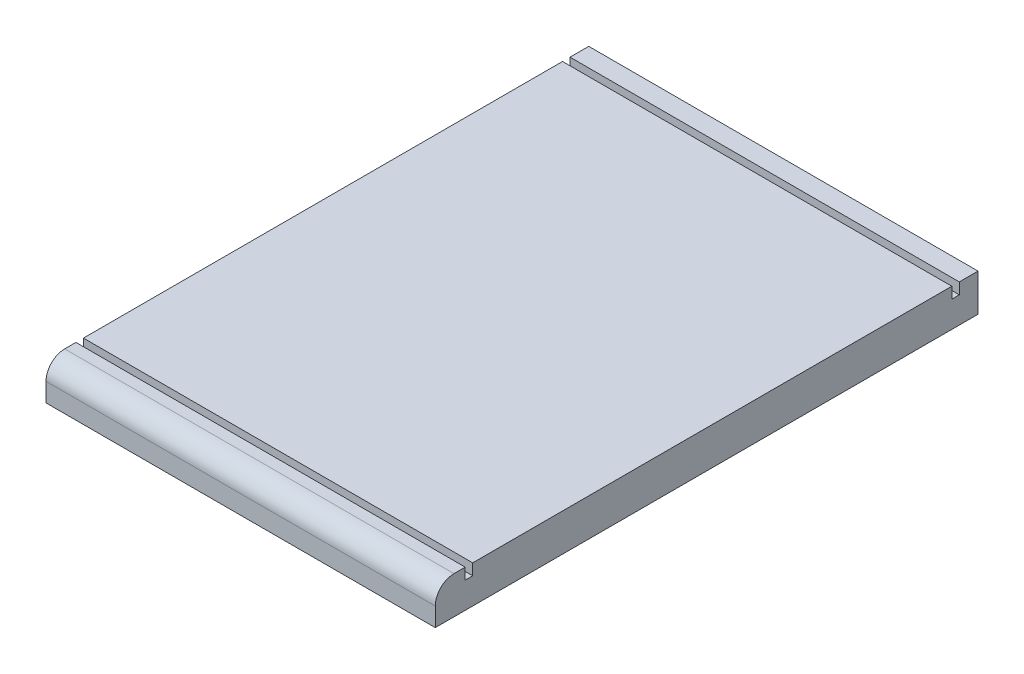
ISO-10303-21;
HEADER;
FILE_DESCRIPTION(('STEP AP214'),'2;1');
FILE_NAME('part.step','',(''),(''),'','','');
FILE_SCHEMA(('AUTOMOTIVE_DESIGN { 1 0 10303 214 1 1 1 1 }'));
ENDSEC;
DATA;
#1=APPLICATION_CONTEXT('core data for automotive mechanical design processes');
#2=APPLICATION_PROTOCOL_DEFINITION('international standard','automotive_design',2000,#1);
#3=PRODUCT_CONTEXT('',#1,'mechanical');
#4=PRODUCT('Part','Part','',(#3));
#5=PRODUCT_RELATED_PRODUCT_CATEGORY('part','',(#4));
#6=PRODUCT_DEFINITION_FORMATION('','',#4);
#7=PRODUCT_DEFINITION_CONTEXT('part definition',#1,'design');
#8=PRODUCT_DEFINITION('design','',#6,#7);
#9=PRODUCT_DEFINITION_SHAPE('','',#8);
#10=(LENGTH_UNIT() NAMED_UNIT(*) SI_UNIT(.MILLI.,.METRE.));
#11=(NAMED_UNIT(*) PLANE_ANGLE_UNIT() SI_UNIT($,.RADIAN.));
#12=(NAMED_UNIT(*) SI_UNIT($,.STERADIAN.) SOLID_ANGLE_UNIT());
#13=UNCERTAINTY_MEASURE_WITH_UNIT(LENGTH_MEASURE(1.E-05),#10,'distance_accuracy_value','');
#14=(GEOMETRIC_REPRESENTATION_CONTEXT(3) GLOBAL_UNCERTAINTY_ASSIGNED_CONTEXT((#13)) GLOBAL_UNIT_ASSIGNED_CONTEXT((#10,
#11,#12)) REPRESENTATION_CONTEXT('',''));
#15=CARTESIAN_POINT('',(0.,0.,0.));
#16=DIRECTION('',(0.,0.,1.));
#17=DIRECTION('',(1.,0.,0.));
#18=AXIS2_PLACEMENT_3D('',#15,#16,#17);
#19=CARTESIAN_POINT('',(0.,10.,0.));
#20=DIRECTION('',(0.,-1.,0.));
#21=DIRECTION('',(0.,0.,-1.));
#22=AXIS2_PLACEMENT_3D('',#19,#20,#21);
#23=PLANE('',#22);
#24=DIRECTION('',(0.,0.,1.));
#25=VECTOR('',#24,1.);
#26=CARTESIAN_POINT('',(-52.,10.,72.5));
#27=LINE('',#26,#25);
#28=CARTESIAN_POINT('',(-52.,10.,-65.5));
#29=VERTEX_POINT('',#28);
#30=CARTESIAN_POINT('',(-52.,10.,62.5));
#31=VERTEX_POINT('',#30);
#32=EDGE_CURVE('E196',#29,#31,#27,.T.);
#33=ORIENTED_EDGE('',*,*,#32,.T.);
#34=DIRECTION('',(-1.,0.,0.));
#35=VECTOR('',#34,1.);
#36=CARTESIAN_POINT('',(-52.,10.,62.5));
#37=LINE('',#36,#35);
#38=CARTESIAN_POINT('',(52.,10.,62.5));
#39=VERTEX_POINT('',#38);
#40=EDGE_CURVE('E146',#39,#31,#37,.T.);
#41=ORIENTED_EDGE('',*,*,#40,.F.);
#42=DIRECTION('',(0.,0.,-1.));
#43=VECTOR('',#42,1.);
#44=CARTESIAN_POINT('',(52.,10.,72.5));
#45=LINE('',#44,#43);
#46=CARTESIAN_POINT('',(52.,10.,-65.5));
#47=VERTEX_POINT('',#46);
#48=EDGE_CURVE('E189',#39,#47,#45,.T.);
#49=ORIENTED_EDGE('',*,*,#48,.T.);
#50=DIRECTION('',(1.,0.,0.));
#51=VECTOR('',#50,1.);
#52=CARTESIAN_POINT('',(-52.,10.,-65.5));
#53=LINE('',#52,#51);
#54=EDGE_CURVE('E171',#29,#47,#53,.T.);
#55=ORIENTED_EDGE('',*,*,#54,.F.);
#56=EDGE_LOOP('',(#33,#41,#49,#55));
#57=FACE_BOUND('',#56,.T.);
#58=ADVANCED_FACE('F33',(#57),#23,.F.);
#59=CARTESIAN_POINT('',(-52.,10.,-72.5));
#60=VERTEX_POINT('',#59);
#61=CARTESIAN_POINT('',(-52.,10.,-67.5));
#62=VERTEX_POINT('',#61);
#63=EDGE_CURVE('E192',#60,#62,#27,.T.);
#64=ORIENTED_EDGE('',*,*,#63,.T.);
#65=DIRECTION('',(-1.,0.,0.));
#66=VECTOR('',#65,1.);
#67=CARTESIAN_POINT('',(-52.,10.,-67.5));
#68=LINE('',#67,#66);
#69=CARTESIAN_POINT('',(52.,10.,-67.5));
#70=VERTEX_POINT('',#69);
#71=EDGE_CURVE('E162',#70,#62,#68,.T.);
#72=ORIENTED_EDGE('',*,*,#71,.F.);
#73=CARTESIAN_POINT('',(52.,10.,-72.5));
#74=VERTEX_POINT('',#73);
#75=EDGE_CURVE('E190',#70,#74,#45,.T.);
#76=ORIENTED_EDGE('',*,*,#75,.T.);
#77=DIRECTION('',(-1.,0.,0.));
#78=VECTOR('',#77,1.);
#79=CARTESIAN_POINT('',(-52.,10.,-72.5));
#80=LINE('',#79,#78);
#81=EDGE_CURVE('E188',#74,#60,#80,.T.);
#82=ORIENTED_EDGE('',*,*,#81,.T.);
#83=EDGE_LOOP('',(#64,#72,#76,#82));
#84=FACE_BOUND('',#83,.T.);
#85=ADVANCED_FACE('F244',(#84),#23,.F.);
#86=CARTESIAN_POINT('',(52.,10.,72.5));
#87=DIRECTION('',(-1.,0.,0.));
#88=DIRECTION('',(0.,0.,1.));
#89=AXIS2_PLACEMENT_3D('',#86,#87,#88);
#90=PLANE('',#89);
#91=CARTESIAN_POINT('',(52.,10.,67.5));
#92=VERTEX_POINT('',#91);
#93=CARTESIAN_POINT('',(52.,10.,64.5));
#94=VERTEX_POINT('',#93);
#95=EDGE_CURVE('E186',#92,#94,#45,.T.);
#96=ORIENTED_EDGE('',*,*,#95,.F.);
#97=CARTESIAN_POINT('',(52.,5.,67.5));
#98=DIRECTION('',(-1.,0.,0.));
#99=DIRECTION('',(0.,0.,1.));
#100=AXIS2_PLACEMENT_3D('',#97,#98,#99);
#101=CIRCLE('',#100,5.);
#102=CARTESIAN_POINT('',(52.,5.,72.5));
#103=VERTEX_POINT('',#102);
#104=EDGE_CURVE('E55',#92,#103,#101,.F.);
#105=ORIENTED_EDGE('',*,*,#104,.T.);
#106=DIRECTION('',(0.,-1.,0.));
#107=VECTOR('',#106,1.);
#108=CARTESIAN_POINT('',(52.,10.,72.5));
#109=LINE('',#108,#107);
#110=CARTESIAN_POINT('',(52.,0.,72.5));
#111=VERTEX_POINT('',#110);
#112=EDGE_CURVE('E195',#103,#111,#109,.T.);
#113=ORIENTED_EDGE('',*,*,#112,.T.);
#114=DIRECTION('',(0.,0.,-1.));
#115=VECTOR('',#114,1.);
#116=CARTESIAN_POINT('',(52.,0.,72.5));
#117=LINE('',#116,#115);
#118=CARTESIAN_POINT('',(52.,0.,-72.5));
#119=VERTEX_POINT('',#118);
#120=EDGE_CURVE('E179',#111,#119,#117,.T.);
#121=ORIENTED_EDGE('',*,*,#120,.T.);
#122=DIRECTION('',(0.,-1.,0.));
#123=VECTOR('',#122,1.);
#124=CARTESIAN_POINT('',(52.,10.,-72.5));
#125=LINE('',#124,#123);
#126=EDGE_CURVE('E213',#74,#119,#125,.T.);
#127=ORIENTED_EDGE('',*,*,#126,.F.);
#128=ORIENTED_EDGE('',*,*,#75,.F.);
#129=DIRECTION('',(0.,1.,0.));
#130=VECTOR('',#129,1.);
#131=CARTESIAN_POINT('',(52.,7.,-67.5));
#132=LINE('',#131,#130);
#133=CARTESIAN_POINT('',(52.,7.,-67.5));
#134=VERTEX_POINT('',#133);
#135=EDGE_CURVE('E180',#134,#70,#132,.T.);
#136=ORIENTED_EDGE('',*,*,#135,.F.);
#137=DIRECTION('',(0.,0.,-1.));
#138=VECTOR('',#137,1.);
#139=CARTESIAN_POINT('',(52.,7.,-67.5));
#140=LINE('',#139,#138);
#141=CARTESIAN_POINT('',(52.,7.,-65.5));
#142=VERTEX_POINT('',#141);
#143=EDGE_CURVE('E165',#142,#134,#140,.T.);
#144=ORIENTED_EDGE('',*,*,#143,.F.);
#145=DIRECTION('',(0.,1.,0.));
#146=VECTOR('',#145,1.);
#147=CARTESIAN_POINT('',(52.,7.,-65.5));
#148=LINE('',#147,#146);
#149=EDGE_CURVE('E182',#142,#47,#148,.T.);
#150=ORIENTED_EDGE('',*,*,#149,.T.);
#151=ORIENTED_EDGE('',*,*,#48,.F.);
#152=DIRECTION('',(0.,1.,0.));
#153=VECTOR('',#152,1.);
#154=CARTESIAN_POINT('',(52.,7.,62.5));
#155=LINE('',#154,#153);
#156=CARTESIAN_POINT('',(52.,7.,62.5));
#157=VERTEX_POINT('',#156);
#158=EDGE_CURVE('E153',#157,#39,#155,.T.);
#159=ORIENTED_EDGE('',*,*,#158,.F.);
#160=DIRECTION('',(0.,0.,-1.));
#161=VECTOR('',#160,1.);
#162=CARTESIAN_POINT('',(52.,7.,62.5));
#163=LINE('',#162,#161);
#164=CARTESIAN_POINT('',(52.,7.,64.5));
#165=VERTEX_POINT('',#164);
#166=EDGE_CURVE('E136',#165,#157,#163,.T.);
#167=ORIENTED_EDGE('',*,*,#166,.F.);
#168=DIRECTION('',(0.,1.,0.));
#169=VECTOR('',#168,1.);
#170=CARTESIAN_POINT('',(52.,7.,64.5));
#171=LINE('',#170,#169);
#172=EDGE_CURVE('E133',#165,#94,#171,.T.);
#173=ORIENTED_EDGE('',*,*,#172,.T.);
#174=EDGE_LOOP('',(#96,#105,#113,#121,#127,#128,#136,#144,#150,#151,#159,#167,#173));
#175=FACE_BOUND('',#174,.T.);
#176=ADVANCED_FACE('F224',(#175),#90,.F.);
#177=CARTESIAN_POINT('',(-52.,10.,-72.5));
#178=DIRECTION('',(0.,0.,1.));
#179=DIRECTION('',(1.,0.,0.));
#180=AXIS2_PLACEMENT_3D('',#177,#178,#179);
#181=PLANE('',#180);
#182=DIRECTION('',(-1.,0.,0.));
#183=VECTOR('',#182,1.);
#184=CARTESIAN_POINT('',(-52.,0.,-72.5));
#185=LINE('',#184,#183);
#186=CARTESIAN_POINT('',(-52.,0.,-72.5));
#187=VERTEX_POINT('',#186);
#188=EDGE_CURVE('E199',#119,#187,#185,.T.);
#189=ORIENTED_EDGE('',*,*,#188,.T.);
#190=DIRECTION('',(0.,-1.,0.));
#191=VECTOR('',#190,1.);
#192=CARTESIAN_POINT('',(-52.,10.,-72.5));
#193=LINE('',#192,#191);
#194=EDGE_CURVE('E210',#60,#187,#193,.T.);
#195=ORIENTED_EDGE('',*,*,#194,.F.);
#196=ORIENTED_EDGE('',*,*,#81,.F.);
#197=ORIENTED_EDGE('',*,*,#126,.T.);
#198=EDGE_LOOP('',(#189,#195,#196,#197));
#199=FACE_BOUND('',#198,.T.);
#200=ADVANCED_FACE('F249',(#199),#181,.F.);
#201=CARTESIAN_POINT('',(-52.,10.,72.5));
#202=DIRECTION('',(1.,0.,0.));
#203=DIRECTION('',(0.,0.,-1.));
#204=AXIS2_PLACEMENT_3D('',#201,#202,#203);
#205=PLANE('',#204);
#206=DIRECTION('',(0.,-1.,0.));
#207=VECTOR('',#206,1.);
#208=CARTESIAN_POINT('',(-52.,10.,72.5));
#209=LINE('',#208,#207);
#210=CARTESIAN_POINT('',(-52.,5.,72.5));
#211=VERTEX_POINT('',#210);
#212=CARTESIAN_POINT('',(-52.,0.,72.5));
#213=VERTEX_POINT('',#212);
#214=EDGE_CURVE('E208',#211,#213,#209,.T.);
#215=ORIENTED_EDGE('',*,*,#214,.F.);
#216=CARTESIAN_POINT('',(-52.,5.,67.5));
#217=DIRECTION('',(1.,0.,0.));
#218=DIRECTION('',(0.,0.,-1.));
#219=AXIS2_PLACEMENT_3D('',#216,#217,#218);
#220=CIRCLE('',#219,5.);
#221=CARTESIAN_POINT('',(-52.,10.,67.5));
#222=VERTEX_POINT('',#221);
#223=EDGE_CURVE('E11',#211,#222,#220,.F.);
#224=ORIENTED_EDGE('',*,*,#223,.T.);
#225=CARTESIAN_POINT('',(-52.,10.,64.5));
#226=VERTEX_POINT('',#225);
#227=EDGE_CURVE('E151',#226,#222,#27,.T.);
#228=ORIENTED_EDGE('',*,*,#227,.F.);
#229=DIRECTION('',(0.,1.,0.));
#230=VECTOR('',#229,1.);
#231=CARTESIAN_POINT('',(-52.,7.,64.5));
#232=LINE('',#231,#230);
#233=CARTESIAN_POINT('',(-52.,7.,64.5));
#234=VERTEX_POINT('',#233);
#235=EDGE_CURVE('E130',#234,#226,#232,.T.);
#236=ORIENTED_EDGE('',*,*,#235,.F.);
#237=DIRECTION('',(0.,0.,1.));
#238=VECTOR('',#237,1.);
#239=CARTESIAN_POINT('',(-52.,7.,62.5));
#240=LINE('',#239,#238);
#241=CARTESIAN_POINT('',(-52.,7.,62.5));
#242=VERTEX_POINT('',#241);
#243=EDGE_CURVE('E137',#242,#234,#240,.T.);
#244=ORIENTED_EDGE('',*,*,#243,.F.);
#245=DIRECTION('',(0.,1.,0.));
#246=VECTOR('',#245,1.);
#247=CARTESIAN_POINT('',(-52.,7.,62.5));
#248=LINE('',#247,#246);
#249=EDGE_CURVE('E174',#242,#31,#248,.T.);
#250=ORIENTED_EDGE('',*,*,#249,.T.);
#251=ORIENTED_EDGE('',*,*,#32,.F.);
#252=DIRECTION('',(0.,1.,0.));
#253=VECTOR('',#252,1.);
#254=CARTESIAN_POINT('',(-52.,7.,-65.5));
#255=LINE('',#254,#253);
#256=CARTESIAN_POINT('',(-52.,7.,-65.5));
#257=VERTEX_POINT('',#256);
#258=EDGE_CURVE('E170',#257,#29,#255,.T.);
#259=ORIENTED_EDGE('',*,*,#258,.F.);
#260=DIRECTION('',(0.,0.,1.));
#261=VECTOR('',#260,1.);
#262=CARTESIAN_POINT('',(-52.,7.,-67.5));
#263=LINE('',#262,#261);
#264=CARTESIAN_POINT('',(-52.,7.,-67.5));
#265=VERTEX_POINT('',#264);
#266=EDGE_CURVE('E158',#265,#257,#263,.T.);
#267=ORIENTED_EDGE('',*,*,#266,.F.);
#268=DIRECTION('',(0.,1.,0.));
#269=VECTOR('',#268,1.);
#270=CARTESIAN_POINT('',(-52.,7.,-67.5));
#271=LINE('',#270,#269);
#272=EDGE_CURVE('E176',#265,#62,#271,.T.);
#273=ORIENTED_EDGE('',*,*,#272,.T.);
#274=ORIENTED_EDGE('',*,*,#63,.F.);
#275=ORIENTED_EDGE('',*,*,#194,.T.);
#276=DIRECTION('',(0.,0.,1.));
#277=VECTOR('',#276,1.);
#278=CARTESIAN_POINT('',(-52.,0.,72.5));
#279=LINE('',#278,#277);
#280=EDGE_CURVE('E201',#187,#213,#279,.T.);
#281=ORIENTED_EDGE('',*,*,#280,.T.);
#282=EDGE_LOOP('',(#215,#224,#228,#236,#244,#250,#251,#259,#267,#273,#274,#275,#281));
#283=FACE_BOUND('',#282,.T.);
#284=ADVANCED_FACE('F149',(#283),#205,.F.);
#285=CARTESIAN_POINT('',(-52.,10.,72.5));
#286=DIRECTION('',(0.,0.,-1.));
#287=DIRECTION('',(-1.,0.,0.));
#288=AXIS2_PLACEMENT_3D('',#285,#286,#287);
#289=PLANE('',#288);
#290=ORIENTED_EDGE('',*,*,#112,.F.);
#291=DIRECTION('',(1.,0.,0.));
#292=VECTOR('',#291,1.);
#293=CARTESIAN_POINT('',(-52.,5.,72.5));
#294=LINE('',#293,#292);
#295=EDGE_CURVE('E41',#103,#211,#294,.F.);
#296=ORIENTED_EDGE('',*,*,#295,.T.);
#297=ORIENTED_EDGE('',*,*,#214,.T.);
#298=DIRECTION('',(1.,0.,0.));
#299=VECTOR('',#298,1.);
#300=CARTESIAN_POINT('',(-52.,0.,72.5));
#301=LINE('',#300,#299);
#302=EDGE_CURVE('E204',#213,#111,#301,.T.);
#303=ORIENTED_EDGE('',*,*,#302,.T.);
#304=EDGE_LOOP('',(#290,#296,#297,#303));
#305=FACE_BOUND('',#304,.T.);
#306=ADVANCED_FACE('F280',(#305),#289,.F.);
#307=ORIENTED_EDGE('',*,*,#227,.T.);
#308=DIRECTION('',(1.,0.,0.));
#309=VECTOR('',#308,1.);
#310=CARTESIAN_POINT('',(0.,10.,67.5));
#311=LINE('',#310,#309);
#312=EDGE_CURVE('E216',#222,#92,#311,.T.);
#313=ORIENTED_EDGE('',*,*,#312,.T.);
#314=ORIENTED_EDGE('',*,*,#95,.T.);
#315=DIRECTION('',(1.,0.,0.));
#316=VECTOR('',#315,1.);
#317=CARTESIAN_POINT('',(-52.,10.,64.5));
#318=LINE('',#317,#316);
#319=EDGE_CURVE('E229',#226,#94,#318,.T.);
#320=ORIENTED_EDGE('',*,*,#319,.F.);
#321=EDGE_LOOP('',(#307,#313,#314,#320));
#322=FACE_BOUND('',#321,.T.);
#323=ADVANCED_FACE('F221',(#322),#23,.F.);
#324=CARTESIAN_POINT('',(0.,0.,0.));
#325=DIRECTION('',(0.,-1.,0.));
#326=DIRECTION('',(0.,0.,-1.));
#327=AXIS2_PLACEMENT_3D('',#324,#325,#326);
#328=PLANE('',#327);
#329=ORIENTED_EDGE('',*,*,#120,.F.);
#330=ORIENTED_EDGE('',*,*,#302,.F.);
#331=ORIENTED_EDGE('',*,*,#280,.F.);
#332=ORIENTED_EDGE('',*,*,#188,.F.);
#333=EDGE_LOOP('',(#329,#330,#331,#332));
#334=FACE_BOUND('',#333,.T.);
#335=ADVANCED_FACE('F254',(#334),#328,.T.);
#336=CARTESIAN_POINT('',(-52.,7.,-67.5));
#337=DIRECTION('',(0.,0.,-1.));
#338=DIRECTION('',(-1.,0.,0.));
#339=AXIS2_PLACEMENT_3D('',#336,#337,#338);
#340=PLANE('',#339);
#341=ORIENTED_EDGE('',*,*,#71,.T.);
#342=ORIENTED_EDGE('',*,*,#272,.F.);
#343=DIRECTION('',(-1.,0.,0.));
#344=VECTOR('',#343,1.);
#345=CARTESIAN_POINT('',(-52.,7.,-67.5));
#346=LINE('',#345,#344);
#347=EDGE_CURVE('E167',#134,#265,#346,.T.);
#348=ORIENTED_EDGE('',*,*,#347,.F.);
#349=ORIENTED_EDGE('',*,*,#135,.T.);
#350=EDGE_LOOP('',(#341,#342,#348,#349));
#351=FACE_BOUND('',#350,.T.);
#352=ADVANCED_FACE('F260',(#351),#340,.F.);
#353=CARTESIAN_POINT('',(-52.,7.,-65.5));
#354=DIRECTION('',(0.,0.,1.));
#355=DIRECTION('',(1.,0.,0.));
#356=AXIS2_PLACEMENT_3D('',#353,#354,#355);
#357=PLANE('',#356);
#358=ORIENTED_EDGE('',*,*,#54,.T.);
#359=ORIENTED_EDGE('',*,*,#149,.F.);
#360=DIRECTION('',(1.,0.,0.));
#361=VECTOR('',#360,1.);
#362=CARTESIAN_POINT('',(-52.,7.,-65.5));
#363=LINE('',#362,#361);
#364=EDGE_CURVE('E161',#257,#142,#363,.T.);
#365=ORIENTED_EDGE('',*,*,#364,.F.);
#366=ORIENTED_EDGE('',*,*,#258,.T.);
#367=EDGE_LOOP('',(#358,#359,#365,#366));
#368=FACE_BOUND('',#367,.T.);
#369=ADVANCED_FACE('F264',(#368),#357,.F.);
#370=CARTESIAN_POINT('',(0.,7.,0.));
#371=DIRECTION('',(0.,1.,0.));
#372=DIRECTION('',(0.,0.,1.));
#373=AXIS2_PLACEMENT_3D('',#370,#371,#372);
#374=PLANE('',#373);
#375=ORIENTED_EDGE('',*,*,#266,.T.);
#376=ORIENTED_EDGE('',*,*,#364,.T.);
#377=ORIENTED_EDGE('',*,*,#143,.T.);
#378=ORIENTED_EDGE('',*,*,#347,.T.);
#379=EDGE_LOOP('',(#375,#376,#377,#378));
#380=FACE_BOUND('',#379,.T.);
#381=ADVANCED_FACE('F262',(#380),#374,.T.);
#382=CARTESIAN_POINT('',(-52.,7.,62.5));
#383=DIRECTION('',(0.,0.,-1.));
#384=DIRECTION('',(-1.,0.,0.));
#385=AXIS2_PLACEMENT_3D('',#382,#383,#384);
#386=PLANE('',#385);
#387=ORIENTED_EDGE('',*,*,#40,.T.);
#388=ORIENTED_EDGE('',*,*,#249,.F.);
#389=DIRECTION('',(-1.,0.,0.));
#390=VECTOR('',#389,1.);
#391=CARTESIAN_POINT('',(-52.,7.,62.5));
#392=LINE('',#391,#390);
#393=EDGE_CURVE('E143',#157,#242,#392,.T.);
#394=ORIENTED_EDGE('',*,*,#393,.F.);
#395=ORIENTED_EDGE('',*,*,#158,.T.);
#396=EDGE_LOOP('',(#387,#388,#394,#395));
#397=FACE_BOUND('',#396,.T.);
#398=ADVANCED_FACE('F234',(#397),#386,.F.);
#399=CARTESIAN_POINT('',(-52.,7.,64.5));
#400=DIRECTION('',(0.,0.,1.));
#401=DIRECTION('',(1.,0.,0.));
#402=AXIS2_PLACEMENT_3D('',#399,#400,#401);
#403=PLANE('',#402);
#404=ORIENTED_EDGE('',*,*,#319,.T.);
#405=ORIENTED_EDGE('',*,*,#172,.F.);
#406=DIRECTION('',(1.,0.,0.));
#407=VECTOR('',#406,1.);
#408=CARTESIAN_POINT('',(-52.,7.,64.5));
#409=LINE('',#408,#407);
#410=EDGE_CURVE('E125',#234,#165,#409,.T.);
#411=ORIENTED_EDGE('',*,*,#410,.F.);
#412=ORIENTED_EDGE('',*,*,#235,.T.);
#413=EDGE_LOOP('',(#404,#405,#411,#412));
#414=FACE_BOUND('',#413,.T.);
#415=ADVANCED_FACE('F128',(#414),#403,.F.);
#416=CARTESIAN_POINT('',(0.,7.,0.));
#417=DIRECTION('',(0.,1.,0.));
#418=DIRECTION('',(0.,0.,1.));
#419=AXIS2_PLACEMENT_3D('',#416,#417,#418);
#420=PLANE('',#419);
#421=ORIENTED_EDGE('',*,*,#243,.T.);
#422=ORIENTED_EDGE('',*,*,#410,.T.);
#423=ORIENTED_EDGE('',*,*,#166,.T.);
#424=ORIENTED_EDGE('',*,*,#393,.T.);
#425=EDGE_LOOP('',(#421,#422,#423,#424));
#426=FACE_BOUND('',#425,.T.);
#427=ADVANCED_FACE('F141',(#426),#420,.T.);
#428=CARTESIAN_POINT('',(0.,5.,67.5));
#429=DIRECTION('',(1.,0.,0.));
#430=DIRECTION('',(0.,0.,-1.));
#431=AXIS2_PLACEMENT_3D('',#428,#429,#430);
#432=CYLINDRICAL_SURFACE('',#431,5.);
#433=ORIENTED_EDGE('',*,*,#223,.F.);
#434=ORIENTED_EDGE('',*,*,#295,.F.);
#435=ORIENTED_EDGE('',*,*,#104,.F.);
#436=ORIENTED_EDGE('',*,*,#312,.F.);
#437=EDGE_LOOP('',(#433,#434,#435,#436));
#438=FACE_BOUND('',#437,.T.);
#439=ADVANCED_FACE('F35',(#438),#432,.T.);
#440=CLOSED_SHELL('',(#58,#85,#176,#200,#284,#306,#323,#335,#352,#369,#381,#398,#415,#427,#439));
#441=MANIFOLD_SOLID_BREP('B2',#440);
#442=ADVANCED_BREP_SHAPE_REPRESENTATION('',(#18,#441),#14);
#443=SHAPE_DEFINITION_REPRESENTATION(#9,#442);
ENDSEC;
END-ISO-10303-21;
